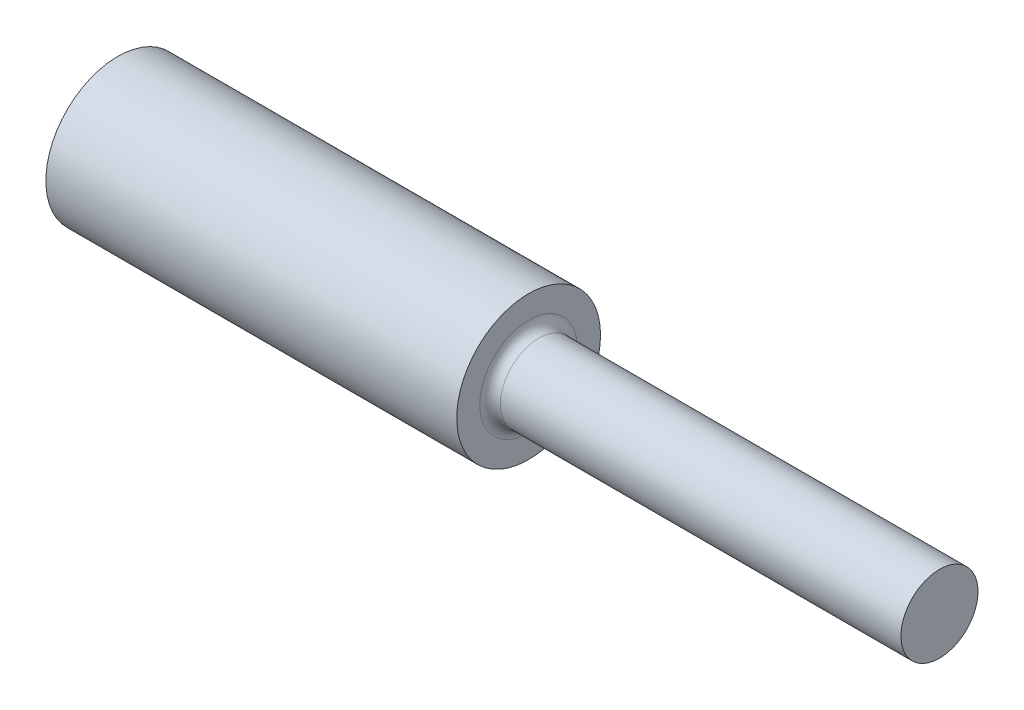
ISO-10303-21;
HEADER;
FILE_DESCRIPTION(('STEP AP214'),'2;1');
FILE_NAME('part.step','',(''),(''),'','','');
FILE_SCHEMA(('AUTOMOTIVE_DESIGN { 1 0 10303 214 1 1 1 1 }'));
ENDSEC;
DATA;
#1=APPLICATION_CONTEXT('core data for automotive mechanical design processes');
#2=APPLICATION_PROTOCOL_DEFINITION('international standard','automotive_design',2000,#1);
#3=PRODUCT_CONTEXT('',#1,'mechanical');
#4=PRODUCT('Part','Part','',(#3));
#5=PRODUCT_RELATED_PRODUCT_CATEGORY('part','',(#4));
#6=PRODUCT_DEFINITION_FORMATION('','',#4);
#7=PRODUCT_DEFINITION_CONTEXT('part definition',#1,'design');
#8=PRODUCT_DEFINITION('design','',#6,#7);
#9=PRODUCT_DEFINITION_SHAPE('','',#8);
#10=(LENGTH_UNIT() NAMED_UNIT(*) SI_UNIT(.MILLI.,.METRE.));
#11=(NAMED_UNIT(*) PLANE_ANGLE_UNIT() SI_UNIT($,.RADIAN.));
#12=(NAMED_UNIT(*) SI_UNIT($,.STERADIAN.) SOLID_ANGLE_UNIT());
#13=UNCERTAINTY_MEASURE_WITH_UNIT(LENGTH_MEASURE(1.E-05),#10,'distance_accuracy_value','');
#14=(GEOMETRIC_REPRESENTATION_CONTEXT(3) GLOBAL_UNCERTAINTY_ASSIGNED_CONTEXT((#13)) GLOBAL_UNIT_ASSIGNED_CONTEXT((#10,
#11,#12)) REPRESENTATION_CONTEXT('',''));
#15=CARTESIAN_POINT('',(0.,0.,0.));
#16=DIRECTION('',(0.,0.,1.));
#17=DIRECTION('',(1.,0.,0.));
#18=AXIS2_PLACEMENT_3D('',#15,#16,#17);
#19=CARTESIAN_POINT('',(101.6,0.,0.));
#20=DIRECTION('',(-1.,0.,0.));
#21=DIRECTION('',(0.,0.,1.));
#22=AXIS2_PLACEMENT_3D('',#19,#20,#21);
#23=PLANE('',#22);
#24=CARTESIAN_POINT('',(101.6,0.,0.));
#25=DIRECTION('',(1.,0.,0.));
#26=DIRECTION('',(0.,0.,-1.));
#27=AXIS2_PLACEMENT_3D('',#24,#25,#26);
#28=CIRCLE('',#27,9.525);
#29=CARTESIAN_POINT('',(101.6,0.,-9.525));
#30=VERTEX_POINT('',#29);
#31=EDGE_CURVE('E44',#30,#30,#28,.T.);
#32=ORIENTED_EDGE('',*,*,#31,.T.);
#33=EDGE_LOOP('',(#32));
#34=FACE_BOUND('',#33,.T.);
#35=ADVANCED_FACE('F34',(#34),#23,.F.);
#36=CARTESIAN_POINT('',(60.4108108108108,0.,0.));
#37=DIRECTION('',(1.,0.,0.));
#38=DIRECTION('',(0.,0.,-1.));
#39=AXIS2_PLACEMENT_3D('',#36,#37,#38);
#40=CYLINDRICAL_SURFACE('',#39,9.525);
#41=CARTESIAN_POINT('',(2.54,0.,0.));
#42=DIRECTION('',(-1.,0.,0.));
#43=DIRECTION('',(0.,0.,1.));
#44=AXIS2_PLACEMENT_3D('',#41,#42,#43);
#45=CIRCLE('',#44,9.525);
#46=CARTESIAN_POINT('',(2.54,0.,9.525));
#47=VERTEX_POINT('',#46);
#48=EDGE_CURVE('E40',#47,#47,#45,.F.);
#49=ORIENTED_EDGE('',*,*,#48,.T.);
#50=EDGE_LOOP('',(#49));
#51=FACE_BOUND('',#50,.T.);
#52=ORIENTED_EDGE('',*,*,#31,.F.);
#53=EDGE_LOOP('',(#52));
#54=FACE_BOUND('',#53,.T.);
#55=ADVANCED_FACE('F73',(#51,#54),#40,.T.);
#56=CARTESIAN_POINT('',(0.,9.525,0.));
#57=DIRECTION('',(-1.,0.,0.));
#58=DIRECTION('',(0.,0.,1.));
#59=AXIS2_PLACEMENT_3D('',#56,#57,#58);
#60=PLANE('',#59);
#61=CARTESIAN_POINT('',(0.,0.,0.));
#62=DIRECTION('',(-1.,0.,0.));
#63=DIRECTION('',(0.,0.,1.));
#64=AXIS2_PLACEMENT_3D('',#61,#62,#63);
#65=CIRCLE('',#64,12.065);
#66=CARTESIAN_POINT('',(0.,0.,12.065));
#67=VERTEX_POINT('',#66);
#68=EDGE_CURVE('E10',#67,#67,#65,.T.);
#69=ORIENTED_EDGE('',*,*,#68,.T.);
#70=EDGE_LOOP('',(#69));
#71=FACE_BOUND('',#70,.T.);
#72=CARTESIAN_POINT('',(0.,0.,0.));
#73=DIRECTION('',(1.,0.,0.));
#74=DIRECTION('',(0.,0.,-1.));
#75=AXIS2_PLACEMENT_3D('',#72,#73,#74);
#76=CIRCLE('',#75,17.78);
#77=CARTESIAN_POINT('',(0.,0.,-17.78));
#78=VERTEX_POINT('',#77);
#79=EDGE_CURVE('E48',#78,#78,#76,.T.);
#80=ORIENTED_EDGE('',*,*,#79,.T.);
#81=EDGE_LOOP('',(#80));
#82=FACE_BOUND('',#81,.T.);
#83=ADVANCED_FACE('F69',(#71,#82),#60,.F.);
#84=CARTESIAN_POINT('',(60.4108108108108,0.,0.));
#85=DIRECTION('',(1.,0.,0.));
#86=DIRECTION('',(0.,0.,-1.));
#87=AXIS2_PLACEMENT_3D('',#84,#85,#86);
#88=CYLINDRICAL_SURFACE('',#87,17.78);
#89=ORIENTED_EDGE('',*,*,#79,.F.);
#90=EDGE_LOOP('',(#89));
#91=FACE_BOUND('',#90,.T.);
#92=CARTESIAN_POINT('',(-101.6,0.,0.));
#93=DIRECTION('',(1.,0.,0.));
#94=DIRECTION('',(0.,0.,-1.));
#95=AXIS2_PLACEMENT_3D('',#92,#93,#94);
#96=CIRCLE('',#95,17.78);
#97=CARTESIAN_POINT('',(-101.6,0.,-17.78));
#98=VERTEX_POINT('',#97);
#99=EDGE_CURVE('E53',#98,#98,#96,.T.);
#100=ORIENTED_EDGE('',*,*,#99,.T.);
#101=EDGE_LOOP('',(#100));
#102=FACE_BOUND('',#101,.T.);
#103=ADVANCED_FACE('F57',(#91,#102),#88,.T.);
#104=CARTESIAN_POINT('',(-101.6,17.78,0.));
#105=DIRECTION('',(1.,0.,0.));
#106=DIRECTION('',(0.,0.,-1.));
#107=AXIS2_PLACEMENT_3D('',#104,#105,#106);
#108=PLANE('',#107);
#109=ORIENTED_EDGE('',*,*,#99,.F.);
#110=EDGE_LOOP('',(#109));
#111=FACE_BOUND('',#110,.T.);
#112=ADVANCED_FACE('F59',(#111),#108,.F.);
#113=CARTESIAN_POINT('',(2.54,0.,0.));
#114=DIRECTION('',(-1.,0.,0.));
#115=DIRECTION('',(0.,0.,1.));
#116=AXIS2_PLACEMENT_3D('',#113,#114,#115);
#117=TOROIDAL_SURFACE('',#116,12.065,2.54);
#118=ORIENTED_EDGE('',*,*,#68,.F.);
#119=EDGE_LOOP('',(#118));
#120=FACE_BOUND('',#119,.T.);
#121=ORIENTED_EDGE('',*,*,#48,.F.);
#122=EDGE_LOOP('',(#121));
#123=FACE_BOUND('',#122,.T.);
#124=ADVANCED_FACE('F61',(#120,#123),#117,.F.);
#125=CLOSED_SHELL('',(#35,#55,#83,#103,#112,#124));
#126=MANIFOLD_SOLID_BREP('B2',#125);
#127=ADVANCED_BREP_SHAPE_REPRESENTATION('',(#18,#126),#14);
#128=SHAPE_DEFINITION_REPRESENTATION(#9,#127);
ENDSEC;
END-ISO-10303-21;
